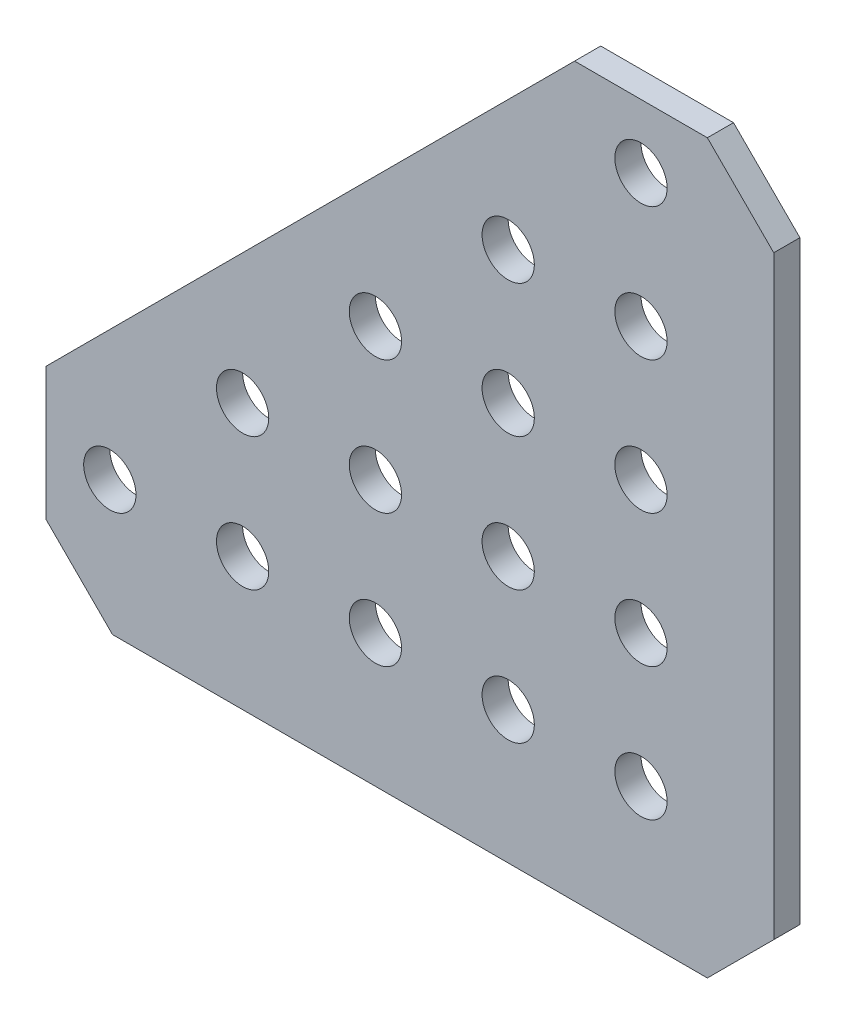
ISO-10303-21;
HEADER;
FILE_DESCRIPTION(('STEP AP214'),'2;1');
FILE_NAME('part.step','',(''),(''),'','','');
FILE_SCHEMA(('AUTOMOTIVE_DESIGN { 1 0 10303 214 1 1 1 1 }'));
ENDSEC;
DATA;
#1=APPLICATION_CONTEXT('core data for automotive mechanical design processes');
#2=APPLICATION_PROTOCOL_DEFINITION('international standard','automotive_design',2000,#1);
#3=PRODUCT_CONTEXT('',#1,'mechanical');
#4=PRODUCT('Part','Part','',(#3));
#5=PRODUCT_RELATED_PRODUCT_CATEGORY('part','',(#4));
#6=PRODUCT_DEFINITION_FORMATION('','',#4);
#7=PRODUCT_DEFINITION_CONTEXT('part definition',#1,'design');
#8=PRODUCT_DEFINITION('design','',#6,#7);
#9=PRODUCT_DEFINITION_SHAPE('','',#8);
#10=(LENGTH_UNIT() NAMED_UNIT(*) SI_UNIT(.MILLI.,.METRE.));
#11=(NAMED_UNIT(*) PLANE_ANGLE_UNIT() SI_UNIT($,.RADIAN.));
#12=(NAMED_UNIT(*) SI_UNIT($,.STERADIAN.) SOLID_ANGLE_UNIT());
#13=UNCERTAINTY_MEASURE_WITH_UNIT(LENGTH_MEASURE(1.E-05),#10,'distance_accuracy_value','');
#14=(GEOMETRIC_REPRESENTATION_CONTEXT(3) GLOBAL_UNCERTAINTY_ASSIGNED_CONTEXT((#13)) GLOBAL_UNIT_ASSIGNED_CONTEXT((#10,
#11,#12)) REPRESENTATION_CONTEXT('',''));
#15=CARTESIAN_POINT('',(0.,0.,0.));
#16=DIRECTION('',(0.,0.,1.));
#17=DIRECTION('',(1.,0.,0.));
#18=AXIS2_PLACEMENT_3D('',#15,#16,#17);
#19=CARTESIAN_POINT('',(12.7,-6.35,1.25));
#20=DIRECTION('',(0.707106781186548,-0.707106781186548,0.));
#21=DIRECTION('',(0.707106781186548,0.707106781186548,0.));
#22=AXIS2_PLACEMENT_3D('',#19,#20,#21);
#23=PLANE('',#22);
#24=DIRECTION('',(-0.707106781186547,-0.707106781186547,0.));
#25=VECTOR('',#24,1.);
#26=CARTESIAN_POINT('',(12.7,-6.35,-1.25));
#27=LINE('',#26,#25);
#28=CARTESIAN_POINT('',(12.7,-6.35,-1.25));
#29=VERTEX_POINT('',#28);
#30=CARTESIAN_POINT('',(6.35,-12.7,-1.25));
#31=VERTEX_POINT('',#30);
#32=EDGE_CURVE('E148',#29,#31,#27,.T.);
#33=ORIENTED_EDGE('',*,*,#32,.F.);
#34=DIRECTION('',(0.,0.,-1.));
#35=VECTOR('',#34,1.);
#36=CARTESIAN_POINT('',(12.7,-6.35,1.25));
#37=LINE('',#36,#35);
#38=CARTESIAN_POINT('',(12.7,-6.35,1.25));
#39=VERTEX_POINT('',#38);
#40=EDGE_CURVE('E11',#39,#29,#37,.T.);
#41=ORIENTED_EDGE('',*,*,#40,.F.);
#42=DIRECTION('',(-0.707106781186547,-0.707106781186547,0.));
#43=VECTOR('',#42,1.);
#44=CARTESIAN_POINT('',(12.7,-6.35,1.25));
#45=LINE('',#44,#43);
#46=CARTESIAN_POINT('',(6.35,-12.7,1.25));
#47=VERTEX_POINT('',#46);
#48=EDGE_CURVE('E177',#39,#47,#45,.T.);
#49=ORIENTED_EDGE('',*,*,#48,.T.);
#50=DIRECTION('',(0.,0.,-1.));
#51=VECTOR('',#50,1.);
#52=CARTESIAN_POINT('',(6.35,-12.7,1.25));
#53=LINE('',#52,#51);
#54=EDGE_CURVE('E48',#47,#31,#53,.T.);
#55=ORIENTED_EDGE('',*,*,#54,.T.);
#56=EDGE_LOOP('',(#33,#41,#49,#55));
#57=FACE_BOUND('',#56,.T.);
#58=ADVANCED_FACE('F45',(#57),#23,.T.);
#59=CARTESIAN_POINT('',(12.6999999999998,50.546,1.25));
#60=DIRECTION('',(1.,0.,0.));
#61=DIRECTION('',(0.,1.,0.));
#62=AXIS2_PLACEMENT_3D('',#59,#60,#61);
#63=PLANE('',#62);
#64=DIRECTION('',(0.,-1.,0.));
#65=VECTOR('',#64,1.);
#66=CARTESIAN_POINT('',(12.6999999999998,50.546,-1.25));
#67=LINE('',#66,#65);
#68=CARTESIAN_POINT('',(12.6999999999998,50.546,-1.25));
#69=VERTEX_POINT('',#68);
#70=EDGE_CURVE('E174',#69,#29,#67,.T.);
#71=ORIENTED_EDGE('',*,*,#70,.F.);
#72=DIRECTION('',(0.,0.,-1.));
#73=VECTOR('',#72,1.);
#74=CARTESIAN_POINT('',(12.6999999999998,50.546,1.25));
#75=LINE('',#74,#73);
#76=CARTESIAN_POINT('',(12.6999999999998,50.546,1.25));
#77=VERTEX_POINT('',#76);
#78=EDGE_CURVE('E55',#77,#69,#75,.T.);
#79=ORIENTED_EDGE('',*,*,#78,.F.);
#80=DIRECTION('',(0.,-1.,0.));
#81=VECTOR('',#80,1.);
#82=CARTESIAN_POINT('',(12.6999999999998,50.546,1.25));
#83=LINE('',#82,#81);
#84=EDGE_CURVE('E134',#77,#39,#83,.T.);
#85=ORIENTED_EDGE('',*,*,#84,.T.);
#86=ORIENTED_EDGE('',*,*,#40,.T.);
#87=EDGE_LOOP('',(#71,#79,#85,#86));
#88=FACE_BOUND('',#87,.T.);
#89=ADVANCED_FACE('F195',(#88),#63,.T.);
#90=CARTESIAN_POINT('',(6.34999999999981,56.896,1.25));
#91=DIRECTION('',(0.707106781186546,0.707106781186549,0.));
#92=DIRECTION('',(-0.707106781186549,0.707106781186546,0.));
#93=AXIS2_PLACEMENT_3D('',#90,#91,#92);
#94=PLANE('',#93);
#95=DIRECTION('',(0.707106781186549,-0.707106781186546,0.));
#96=VECTOR('',#95,1.);
#97=CARTESIAN_POINT('',(6.34999999999981,56.896,-1.25));
#98=LINE('',#97,#96);
#99=CARTESIAN_POINT('',(6.34999999999981,56.896,-1.25));
#100=VERTEX_POINT('',#99);
#101=EDGE_CURVE('E120',#100,#69,#98,.T.);
#102=ORIENTED_EDGE('',*,*,#101,.F.);
#103=DIRECTION('',(0.,0.,-1.));
#104=VECTOR('',#103,1.);
#105=CARTESIAN_POINT('',(6.34999999999981,56.896,1.25));
#106=LINE('',#105,#104);
#107=CARTESIAN_POINT('',(6.34999999999981,56.896,1.25));
#108=VERTEX_POINT('',#107);
#109=EDGE_CURVE('E115',#108,#100,#106,.T.);
#110=ORIENTED_EDGE('',*,*,#109,.F.);
#111=DIRECTION('',(0.707106781186549,-0.707106781186546,0.));
#112=VECTOR('',#111,1.);
#113=CARTESIAN_POINT('',(6.34999999999981,56.896,1.25));
#114=LINE('',#113,#112);
#115=EDGE_CURVE('E118',#108,#77,#114,.T.);
#116=ORIENTED_EDGE('',*,*,#115,.T.);
#117=ORIENTED_EDGE('',*,*,#78,.T.);
#118=EDGE_LOOP('',(#102,#110,#116,#117));
#119=FACE_BOUND('',#118,.T.);
#120=ADVANCED_FACE('F117',(#119),#94,.T.);
#121=CARTESIAN_POINT('',(-6.35000000000021,56.896,1.25));
#122=DIRECTION('',(0.,1.,0.));
#123=DIRECTION('',(0.,0.,1.));
#124=AXIS2_PLACEMENT_3D('',#121,#122,#123);
#125=PLANE('',#124);
#126=DIRECTION('',(1.,0.,0.));
#127=VECTOR('',#126,1.);
#128=CARTESIAN_POINT('',(-6.35000000000021,56.896,-1.25));
#129=LINE('',#128,#127);
#130=CARTESIAN_POINT('',(-6.35000000000021,56.896,-1.25));
#131=VERTEX_POINT('',#130);
#132=EDGE_CURVE('E169',#131,#100,#129,.T.);
#133=ORIENTED_EDGE('',*,*,#132,.F.);
#134=DIRECTION('',(0.,0.,-1.));
#135=VECTOR('',#134,1.);
#136=CARTESIAN_POINT('',(-6.35000000000021,56.896,1.25));
#137=LINE('',#136,#135);
#138=CARTESIAN_POINT('',(-6.35000000000021,56.896,1.25));
#139=VERTEX_POINT('',#138);
#140=EDGE_CURVE('E126',#139,#131,#137,.T.);
#141=ORIENTED_EDGE('',*,*,#140,.F.);
#142=DIRECTION('',(1.,0.,0.));
#143=VECTOR('',#142,1.);
#144=CARTESIAN_POINT('',(-6.35000000000021,56.896,1.25));
#145=LINE('',#144,#143);
#146=EDGE_CURVE('E132',#139,#108,#145,.T.);
#147=ORIENTED_EDGE('',*,*,#146,.T.);
#148=ORIENTED_EDGE('',*,*,#109,.T.);
#149=EDGE_LOOP('',(#133,#141,#147,#148));
#150=FACE_BOUND('',#149,.T.);
#151=ADVANCED_FACE('F137',(#150),#125,.T.);
#152=CARTESIAN_POINT('',(-56.896,6.35,1.25));
#153=DIRECTION('',(-0.707106781186549,0.707106781186546,0.));
#154=DIRECTION('',(-0.707106781186546,-0.707106781186549,0.));
#155=AXIS2_PLACEMENT_3D('',#152,#153,#154);
#156=PLANE('',#155);
#157=DIRECTION('',(0.707106781186546,0.707106781186549,0.));
#158=VECTOR('',#157,1.);
#159=CARTESIAN_POINT('',(-56.896,6.35,-1.25));
#160=LINE('',#159,#158);
#161=CARTESIAN_POINT('',(-56.896,6.35,-1.25));
#162=VERTEX_POINT('',#161);
#163=EDGE_CURVE('E165',#162,#131,#160,.T.);
#164=ORIENTED_EDGE('',*,*,#163,.F.);
#165=DIRECTION('',(0.,0.,-1.));
#166=VECTOR('',#165,1.);
#167=CARTESIAN_POINT('',(-56.896,6.35,1.25));
#168=LINE('',#167,#166);
#169=CARTESIAN_POINT('',(-56.896,6.35,1.25));
#170=VERTEX_POINT('',#169);
#171=EDGE_CURVE('E183',#170,#162,#168,.T.);
#172=ORIENTED_EDGE('',*,*,#171,.F.);
#173=DIRECTION('',(0.707106781186546,0.707106781186549,0.));
#174=VECTOR('',#173,1.);
#175=CARTESIAN_POINT('',(-56.896,6.35,1.25));
#176=LINE('',#175,#174);
#177=EDGE_CURVE('E139',#170,#139,#176,.T.);
#178=ORIENTED_EDGE('',*,*,#177,.T.);
#179=ORIENTED_EDGE('',*,*,#140,.T.);
#180=EDGE_LOOP('',(#164,#172,#178,#179));
#181=FACE_BOUND('',#180,.T.);
#182=ADVANCED_FACE('F208',(#181),#156,.T.);
#183=CARTESIAN_POINT('',(-56.896,-6.35,1.25));
#184=DIRECTION('',(-1.,0.,0.));
#185=DIRECTION('',(0.,0.,1.));
#186=AXIS2_PLACEMENT_3D('',#183,#184,#185);
#187=PLANE('',#186);
#188=DIRECTION('',(0.,1.,0.));
#189=VECTOR('',#188,1.);
#190=CARTESIAN_POINT('',(-56.896,-6.35,-1.25));
#191=LINE('',#190,#189);
#192=CARTESIAN_POINT('',(-56.896,-6.35,-1.25));
#193=VERTEX_POINT('',#192);
#194=EDGE_CURVE('E161',#193,#162,#191,.T.);
#195=ORIENTED_EDGE('',*,*,#194,.F.);
#196=DIRECTION('',(0.,0.,-1.));
#197=VECTOR('',#196,1.);
#198=CARTESIAN_POINT('',(-56.896,-6.35,1.25));
#199=LINE('',#198,#197);
#200=CARTESIAN_POINT('',(-56.896,-6.35,1.25));
#201=VERTEX_POINT('',#200);
#202=EDGE_CURVE('E186',#201,#193,#199,.T.);
#203=ORIENTED_EDGE('',*,*,#202,.F.);
#204=DIRECTION('',(0.,1.,0.));
#205=VECTOR('',#204,1.);
#206=CARTESIAN_POINT('',(-56.896,-6.35,1.25));
#207=LINE('',#206,#205);
#208=EDGE_CURVE('E142',#201,#170,#207,.T.);
#209=ORIENTED_EDGE('',*,*,#208,.T.);
#210=ORIENTED_EDGE('',*,*,#171,.T.);
#211=EDGE_LOOP('',(#195,#203,#209,#210));
#212=FACE_BOUND('',#211,.T.);
#213=ADVANCED_FACE('F211',(#212),#187,.T.);
#214=CARTESIAN_POINT('',(-50.546,-12.7,1.25));
#215=DIRECTION('',(-0.707106781186547,-0.707106781186548,0.));
#216=DIRECTION('',(0.707106781186548,-0.707106781186547,0.));
#217=AXIS2_PLACEMENT_3D('',#214,#215,#216);
#218=PLANE('',#217);
#219=DIRECTION('',(-0.707106781186548,0.707106781186547,0.));
#220=VECTOR('',#219,1.);
#221=CARTESIAN_POINT('',(-50.546,-12.7,-1.25));
#222=LINE('',#221,#220);
#223=CARTESIAN_POINT('',(-50.546,-12.7,-1.25));
#224=VERTEX_POINT('',#223);
#225=EDGE_CURVE('E157',#224,#193,#222,.T.);
#226=ORIENTED_EDGE('',*,*,#225,.F.);
#227=DIRECTION('',(0.,0.,-1.));
#228=VECTOR('',#227,1.);
#229=CARTESIAN_POINT('',(-50.546,-12.7,1.25));
#230=LINE('',#229,#228);
#231=CARTESIAN_POINT('',(-50.546,-12.7,1.25));
#232=VERTEX_POINT('',#231);
#233=EDGE_CURVE('E188',#232,#224,#230,.T.);
#234=ORIENTED_EDGE('',*,*,#233,.F.);
#235=DIRECTION('',(-0.707106781186548,0.707106781186547,0.));
#236=VECTOR('',#235,1.);
#237=CARTESIAN_POINT('',(-50.546,-12.7,1.25));
#238=LINE('',#237,#236);
#239=EDGE_CURVE('E419',#232,#201,#238,.T.);
#240=ORIENTED_EDGE('',*,*,#239,.T.);
#241=ORIENTED_EDGE('',*,*,#202,.T.);
#242=EDGE_LOOP('',(#226,#234,#240,#241));
#243=FACE_BOUND('',#242,.T.);
#244=ADVANCED_FACE('F215',(#243),#218,.T.);
#245=CARTESIAN_POINT('',(6.35,-12.7,1.25));
#246=DIRECTION('',(0.,-1.,0.));
#247=DIRECTION('',(0.,0.,-1.));
#248=AXIS2_PLACEMENT_3D('',#245,#246,#247);
#249=PLANE('',#248);
#250=DIRECTION('',(-1.,0.,0.));
#251=VECTOR('',#250,1.);
#252=CARTESIAN_POINT('',(6.35,-12.7,-1.25));
#253=LINE('',#252,#251);
#254=EDGE_CURVE('E152',#31,#224,#253,.T.);
#255=ORIENTED_EDGE('',*,*,#254,.F.);
#256=ORIENTED_EDGE('',*,*,#54,.F.);
#257=DIRECTION('',(-1.,0.,0.));
#258=VECTOR('',#257,1.);
#259=CARTESIAN_POINT('',(6.35,-12.7,1.25));
#260=LINE('',#259,#258);
#261=EDGE_CURVE('E416',#47,#232,#260,.T.);
#262=ORIENTED_EDGE('',*,*,#261,.T.);
#263=ORIENTED_EDGE('',*,*,#233,.T.);
#264=EDGE_LOOP('',(#255,#256,#262,#263));
#265=FACE_BOUND('',#264,.T.);
#266=ADVANCED_FACE('F192',(#265),#249,.T.);
#267=CARTESIAN_POINT('',(0.,0.,1.25));
#268=DIRECTION('',(0.,0.,-1.));
#269=DIRECTION('',(-1.,0.,0.));
#270=AXIS2_PLACEMENT_3D('',#267,#268,#269);
#271=PLANE('',#270);
#272=CARTESIAN_POINT('',(-38.1,12.7,1.25));
#273=DIRECTION('',(0.,0.,-1.));
#274=DIRECTION('',(1.,0.,0.));
#275=AXIS2_PLACEMENT_3D('',#272,#273,#274);
#276=CIRCLE('',#275,2.5);
#277=CARTESIAN_POINT('',(-35.6,12.7,1.25));
#278=VERTEX_POINT('',#277);
#279=EDGE_CURVE('E294',#278,#278,#276,.T.);
#280=ORIENTED_EDGE('',*,*,#279,.T.);
#281=EDGE_LOOP('',(#280));
#282=FACE_BOUND('',#281,.T.);
#283=CARTESIAN_POINT('',(-25.4,25.4,1.25));
#284=DIRECTION('',(0.,0.,-1.));
#285=DIRECTION('',(1.,0.,0.));
#286=AXIS2_PLACEMENT_3D('',#283,#284,#285);
#287=CIRCLE('',#286,2.5);
#288=CARTESIAN_POINT('',(-22.9,25.4,1.25));
#289=VERTEX_POINT('',#288);
#290=EDGE_CURVE('E304',#289,#289,#287,.T.);
#291=ORIENTED_EDGE('',*,*,#290,.T.);
#292=EDGE_LOOP('',(#291));
#293=FACE_BOUND('',#292,.T.);
#294=CARTESIAN_POINT('',(-25.4,12.7,1.25));
#295=DIRECTION('',(0.,0.,-1.));
#296=DIRECTION('',(1.,0.,0.));
#297=AXIS2_PLACEMENT_3D('',#294,#295,#296);
#298=CIRCLE('',#297,2.5);
#299=CARTESIAN_POINT('',(-22.9,12.7,1.25));
#300=VERTEX_POINT('',#299);
#301=EDGE_CURVE('E312',#300,#300,#298,.T.);
#302=ORIENTED_EDGE('',*,*,#301,.T.);
#303=EDGE_LOOP('',(#302));
#304=FACE_BOUND('',#303,.T.);
#305=CARTESIAN_POINT('',(-12.7,38.1,1.25));
#306=DIRECTION('',(0.,0.,-1.));
#307=DIRECTION('',(1.,0.,0.));
#308=AXIS2_PLACEMENT_3D('',#305,#306,#307);
#309=CIRCLE('',#308,2.5);
#310=CARTESIAN_POINT('',(-10.2,38.1,1.25));
#311=VERTEX_POINT('',#310);
#312=EDGE_CURVE('E320',#311,#311,#309,.T.);
#313=ORIENTED_EDGE('',*,*,#312,.T.);
#314=EDGE_LOOP('',(#313));
#315=FACE_BOUND('',#314,.T.);
#316=CARTESIAN_POINT('',(-12.7,25.4,1.25));
#317=DIRECTION('',(0.,0.,-1.));
#318=DIRECTION('',(1.,0.,0.));
#319=AXIS2_PLACEMENT_3D('',#316,#317,#318);
#320=CIRCLE('',#319,2.5);
#321=CARTESIAN_POINT('',(-10.2,25.4,1.25));
#322=VERTEX_POINT('',#321);
#323=EDGE_CURVE('E328',#322,#322,#320,.T.);
#324=ORIENTED_EDGE('',*,*,#323,.T.);
#325=EDGE_LOOP('',(#324));
#326=FACE_BOUND('',#325,.T.);
#327=CARTESIAN_POINT('',(-12.7,12.7,1.25));
#328=DIRECTION('',(0.,0.,-1.));
#329=DIRECTION('',(1.,0.,0.));
#330=AXIS2_PLACEMENT_3D('',#327,#328,#329);
#331=CIRCLE('',#330,2.5);
#332=CARTESIAN_POINT('',(-10.2,12.7,1.25));
#333=VERTEX_POINT('',#332);
#334=EDGE_CURVE('E336',#333,#333,#331,.T.);
#335=ORIENTED_EDGE('',*,*,#334,.T.);
#336=EDGE_LOOP('',(#335));
#337=FACE_BOUND('',#336,.T.);
#338=CARTESIAN_POINT('',(0.,38.1,1.25));
#339=DIRECTION('',(0.,0.,-1.));
#340=DIRECTION('',(1.,0.,0.));
#341=AXIS2_PLACEMENT_3D('',#338,#339,#340);
#342=CIRCLE('',#341,2.5);
#343=CARTESIAN_POINT('',(2.50000000000004,38.1,1.25));
#344=VERTEX_POINT('',#343);
#345=EDGE_CURVE('E344',#344,#344,#342,.T.);
#346=ORIENTED_EDGE('',*,*,#345,.T.);
#347=EDGE_LOOP('',(#346));
#348=FACE_BOUND('',#347,.T.);
#349=CARTESIAN_POINT('',(0.,50.8,1.25));
#350=DIRECTION('',(0.,0.,-1.));
#351=DIRECTION('',(1.,0.,0.));
#352=AXIS2_PLACEMENT_3D('',#349,#350,#351);
#353=CIRCLE('',#352,2.5);
#354=CARTESIAN_POINT('',(2.5,50.8,1.25));
#355=VERTEX_POINT('',#354);
#356=EDGE_CURVE('E352',#355,#355,#353,.T.);
#357=ORIENTED_EDGE('',*,*,#356,.T.);
#358=EDGE_LOOP('',(#357));
#359=FACE_BOUND('',#358,.T.);
#360=CARTESIAN_POINT('',(-38.1,0.,1.25));
#361=DIRECTION('',(0.,0.,-1.));
#362=DIRECTION('',(1.,0.,0.));
#363=AXIS2_PLACEMENT_3D('',#360,#361,#362);
#364=CIRCLE('',#363,2.5);
#365=CARTESIAN_POINT('',(-35.6,0.,1.25));
#366=VERTEX_POINT('',#365);
#367=EDGE_CURVE('E360',#366,#366,#364,.T.);
#368=ORIENTED_EDGE('',*,*,#367,.T.);
#369=EDGE_LOOP('',(#368));
#370=FACE_BOUND('',#369,.T.);
#371=CARTESIAN_POINT('',(-50.8,0.,1.25));
#372=DIRECTION('',(0.,0.,-1.));
#373=DIRECTION('',(1.,0.,0.));
#374=AXIS2_PLACEMENT_3D('',#371,#372,#373);
#375=CIRCLE('',#374,2.5);
#376=CARTESIAN_POINT('',(-48.3,0.,1.25));
#377=VERTEX_POINT('',#376);
#378=EDGE_CURVE('E368',#377,#377,#375,.T.);
#379=ORIENTED_EDGE('',*,*,#378,.T.);
#380=EDGE_LOOP('',(#379));
#381=FACE_BOUND('',#380,.T.);
#382=CARTESIAN_POINT('',(0.,0.,1.25));
#383=DIRECTION('',(0.,0.,-1.));
#384=DIRECTION('',(1.,0.,0.));
#385=AXIS2_PLACEMENT_3D('',#382,#383,#384);
#386=CIRCLE('',#385,2.5);
#387=CARTESIAN_POINT('',(2.5,0.,1.25));
#388=VERTEX_POINT('',#387);
#389=EDGE_CURVE('E376',#388,#388,#386,.T.);
#390=ORIENTED_EDGE('',*,*,#389,.T.);
#391=EDGE_LOOP('',(#390));
#392=FACE_BOUND('',#391,.T.);
#393=CARTESIAN_POINT('',(-25.4,0.,1.25));
#394=DIRECTION('',(0.,0.,-1.));
#395=DIRECTION('',(1.,0.,0.));
#396=AXIS2_PLACEMENT_3D('',#393,#394,#395);
#397=CIRCLE('',#396,2.5);
#398=CARTESIAN_POINT('',(-22.9,0.,1.25));
#399=VERTEX_POINT('',#398);
#400=EDGE_CURVE('E384',#399,#399,#397,.T.);
#401=ORIENTED_EDGE('',*,*,#400,.T.);
#402=EDGE_LOOP('',(#401));
#403=FACE_BOUND('',#402,.T.);
#404=CARTESIAN_POINT('',(-12.7,0.,1.25));
#405=DIRECTION('',(0.,0.,-1.));
#406=DIRECTION('',(1.,0.,0.));
#407=AXIS2_PLACEMENT_3D('',#404,#405,#406);
#408=CIRCLE('',#407,2.5);
#409=CARTESIAN_POINT('',(-10.2,0.,1.25));
#410=VERTEX_POINT('',#409);
#411=EDGE_CURVE('E392',#410,#410,#408,.T.);
#412=ORIENTED_EDGE('',*,*,#411,.T.);
#413=EDGE_LOOP('',(#412));
#414=FACE_BOUND('',#413,.T.);
#415=CARTESIAN_POINT('',(0.,25.4,1.25));
#416=DIRECTION('',(0.,0.,-1.));
#417=DIRECTION('',(1.,0.,0.));
#418=AXIS2_PLACEMENT_3D('',#415,#416,#417);
#419=CIRCLE('',#418,2.5);
#420=CARTESIAN_POINT('',(2.50000000000008,25.4,1.25));
#421=VERTEX_POINT('',#420);
#422=EDGE_CURVE('E400',#421,#421,#419,.T.);
#423=ORIENTED_EDGE('',*,*,#422,.T.);
#424=EDGE_LOOP('',(#423));
#425=FACE_BOUND('',#424,.T.);
#426=CARTESIAN_POINT('',(1.19131612205636E-13,12.7,1.25));
#427=DIRECTION('',(0.,0.,-1.));
#428=DIRECTION('',(1.,0.,0.));
#429=AXIS2_PLACEMENT_3D('',#426,#427,#428);
#430=CIRCLE('',#429,2.5);
#431=CARTESIAN_POINT('',(2.50000000000012,12.7,1.25));
#432=VERTEX_POINT('',#431);
#433=EDGE_CURVE('E153',#432,#432,#430,.T.);
#434=ORIENTED_EDGE('',*,*,#433,.T.);
#435=EDGE_LOOP('',(#434));
#436=FACE_BOUND('',#435,.T.);
#437=ORIENTED_EDGE('',*,*,#48,.F.);
#438=ORIENTED_EDGE('',*,*,#84,.F.);
#439=ORIENTED_EDGE('',*,*,#115,.F.);
#440=ORIENTED_EDGE('',*,*,#146,.F.);
#441=ORIENTED_EDGE('',*,*,#177,.F.);
#442=ORIENTED_EDGE('',*,*,#208,.F.);
#443=ORIENTED_EDGE('',*,*,#239,.F.);
#444=ORIENTED_EDGE('',*,*,#261,.F.);
#445=EDGE_LOOP('',(#437,#438,#439,#440,#441,#442,#443,#444));
#446=FACE_BOUND('',#445,.T.);
#447=ADVANCED_FACE('F130',(#282,#293,#304,#315,#326,#337,#348,#359,#370,#381,#392,#403,#414,
#425,#436,#446),#271,.F.);
#448=CARTESIAN_POINT('',(0.,0.,-1.25));
#449=DIRECTION('',(0.,0.,-1.));
#450=DIRECTION('',(-1.,0.,0.));
#451=AXIS2_PLACEMENT_3D('',#448,#449,#450);
#452=PLANE('',#451);
#453=CARTESIAN_POINT('',(-38.1,12.7,-1.25));
#454=DIRECTION('',(0.,0.,-1.));
#455=DIRECTION('',(1.,0.,0.));
#456=AXIS2_PLACEMENT_3D('',#453,#454,#455);
#457=CIRCLE('',#456,2.5);
#458=CARTESIAN_POINT('',(-35.6,12.7,-1.25));
#459=VERTEX_POINT('',#458);
#460=EDGE_CURVE('E297',#459,#459,#457,.T.);
#461=ORIENTED_EDGE('',*,*,#460,.F.);
#462=EDGE_LOOP('',(#461));
#463=FACE_BOUND('',#462,.T.);
#464=CARTESIAN_POINT('',(-25.4,25.4,-1.25));
#465=DIRECTION('',(0.,0.,-1.));
#466=DIRECTION('',(1.,0.,0.));
#467=AXIS2_PLACEMENT_3D('',#464,#465,#466);
#468=CIRCLE('',#467,2.5);
#469=CARTESIAN_POINT('',(-22.9,25.4,-1.25));
#470=VERTEX_POINT('',#469);
#471=EDGE_CURVE('E301',#470,#470,#468,.T.);
#472=ORIENTED_EDGE('',*,*,#471,.F.);
#473=EDGE_LOOP('',(#472));
#474=FACE_BOUND('',#473,.T.);
#475=CARTESIAN_POINT('',(-25.4,12.7,-1.25));
#476=DIRECTION('',(0.,0.,-1.));
#477=DIRECTION('',(1.,0.,0.));
#478=AXIS2_PLACEMENT_3D('',#475,#476,#477);
#479=CIRCLE('',#478,2.5);
#480=CARTESIAN_POINT('',(-22.9,12.7,-1.25));
#481=VERTEX_POINT('',#480);
#482=EDGE_CURVE('E308',#481,#481,#479,.T.);
#483=ORIENTED_EDGE('',*,*,#482,.F.);
#484=EDGE_LOOP('',(#483));
#485=FACE_BOUND('',#484,.T.);
#486=CARTESIAN_POINT('',(-12.7,38.1,-1.25));
#487=DIRECTION('',(0.,0.,-1.));
#488=DIRECTION('',(1.,0.,0.));
#489=AXIS2_PLACEMENT_3D('',#486,#487,#488);
#490=CIRCLE('',#489,2.5);
#491=CARTESIAN_POINT('',(-10.2,38.1,-1.25));
#492=VERTEX_POINT('',#491);
#493=EDGE_CURVE('E316',#492,#492,#490,.T.);
#494=ORIENTED_EDGE('',*,*,#493,.F.);
#495=EDGE_LOOP('',(#494));
#496=FACE_BOUND('',#495,.T.);
#497=CARTESIAN_POINT('',(-12.7,25.4,-1.25));
#498=DIRECTION('',(0.,0.,-1.));
#499=DIRECTION('',(1.,0.,0.));
#500=AXIS2_PLACEMENT_3D('',#497,#498,#499);
#501=CIRCLE('',#500,2.5);
#502=CARTESIAN_POINT('',(-10.2,25.4,-1.25));
#503=VERTEX_POINT('',#502);
#504=EDGE_CURVE('E324',#503,#503,#501,.T.);
#505=ORIENTED_EDGE('',*,*,#504,.F.);
#506=EDGE_LOOP('',(#505));
#507=FACE_BOUND('',#506,.T.);
#508=CARTESIAN_POINT('',(-12.7,12.7,-1.25));
#509=DIRECTION('',(0.,0.,-1.));
#510=DIRECTION('',(1.,0.,0.));
#511=AXIS2_PLACEMENT_3D('',#508,#509,#510);
#512=CIRCLE('',#511,2.5);
#513=CARTESIAN_POINT('',(-10.2,12.7,-1.25));
#514=VERTEX_POINT('',#513);
#515=EDGE_CURVE('E332',#514,#514,#512,.T.);
#516=ORIENTED_EDGE('',*,*,#515,.F.);
#517=EDGE_LOOP('',(#516));
#518=FACE_BOUND('',#517,.T.);
#519=CARTESIAN_POINT('',(0.,38.1,-1.25));
#520=DIRECTION('',(0.,0.,-1.));
#521=DIRECTION('',(1.,0.,0.));
#522=AXIS2_PLACEMENT_3D('',#519,#520,#521);
#523=CIRCLE('',#522,2.5);
#524=CARTESIAN_POINT('',(2.50000000000004,38.1,-1.25));
#525=VERTEX_POINT('',#524);
#526=EDGE_CURVE('E340',#525,#525,#523,.T.);
#527=ORIENTED_EDGE('',*,*,#526,.F.);
#528=EDGE_LOOP('',(#527));
#529=FACE_BOUND('',#528,.T.);
#530=CARTESIAN_POINT('',(0.,50.8,-1.25));
#531=DIRECTION('',(0.,0.,-1.));
#532=DIRECTION('',(1.,0.,0.));
#533=AXIS2_PLACEMENT_3D('',#530,#531,#532);
#534=CIRCLE('',#533,2.5);
#535=CARTESIAN_POINT('',(2.5,50.8,-1.25));
#536=VERTEX_POINT('',#535);
#537=EDGE_CURVE('E348',#536,#536,#534,.T.);
#538=ORIENTED_EDGE('',*,*,#537,.F.);
#539=EDGE_LOOP('',(#538));
#540=FACE_BOUND('',#539,.T.);
#541=CARTESIAN_POINT('',(-38.1,0.,-1.25));
#542=DIRECTION('',(0.,0.,-1.));
#543=DIRECTION('',(1.,0.,0.));
#544=AXIS2_PLACEMENT_3D('',#541,#542,#543);
#545=CIRCLE('',#544,2.5);
#546=CARTESIAN_POINT('',(-35.6,0.,-1.25));
#547=VERTEX_POINT('',#546);
#548=EDGE_CURVE('E356',#547,#547,#545,.T.);
#549=ORIENTED_EDGE('',*,*,#548,.F.);
#550=EDGE_LOOP('',(#549));
#551=FACE_BOUND('',#550,.T.);
#552=CARTESIAN_POINT('',(-50.8,0.,-1.25));
#553=DIRECTION('',(0.,0.,-1.));
#554=DIRECTION('',(1.,0.,0.));
#555=AXIS2_PLACEMENT_3D('',#552,#553,#554);
#556=CIRCLE('',#555,2.5);
#557=CARTESIAN_POINT('',(-48.3,0.,-1.25));
#558=VERTEX_POINT('',#557);
#559=EDGE_CURVE('E364',#558,#558,#556,.T.);
#560=ORIENTED_EDGE('',*,*,#559,.F.);
#561=EDGE_LOOP('',(#560));
#562=FACE_BOUND('',#561,.T.);
#563=CARTESIAN_POINT('',(0.,0.,-1.25));
#564=DIRECTION('',(0.,0.,-1.));
#565=DIRECTION('',(1.,0.,0.));
#566=AXIS2_PLACEMENT_3D('',#563,#564,#565);
#567=CIRCLE('',#566,2.5);
#568=CARTESIAN_POINT('',(2.5,0.,-1.25));
#569=VERTEX_POINT('',#568);
#570=EDGE_CURVE('E372',#569,#569,#567,.T.);
#571=ORIENTED_EDGE('',*,*,#570,.F.);
#572=EDGE_LOOP('',(#571));
#573=FACE_BOUND('',#572,.T.);
#574=CARTESIAN_POINT('',(-25.4,0.,-1.25));
#575=DIRECTION('',(0.,0.,-1.));
#576=DIRECTION('',(1.,0.,0.));
#577=AXIS2_PLACEMENT_3D('',#574,#575,#576);
#578=CIRCLE('',#577,2.5);
#579=CARTESIAN_POINT('',(-22.9,0.,-1.25));
#580=VERTEX_POINT('',#579);
#581=EDGE_CURVE('E380',#580,#580,#578,.T.);
#582=ORIENTED_EDGE('',*,*,#581,.F.);
#583=EDGE_LOOP('',(#582));
#584=FACE_BOUND('',#583,.T.);
#585=CARTESIAN_POINT('',(-12.7,0.,-1.25));
#586=DIRECTION('',(0.,0.,-1.));
#587=DIRECTION('',(1.,0.,0.));
#588=AXIS2_PLACEMENT_3D('',#585,#586,#587);
#589=CIRCLE('',#588,2.5);
#590=CARTESIAN_POINT('',(-10.2,0.,-1.25));
#591=VERTEX_POINT('',#590);
#592=EDGE_CURVE('E388',#591,#591,#589,.T.);
#593=ORIENTED_EDGE('',*,*,#592,.F.);
#594=EDGE_LOOP('',(#593));
#595=FACE_BOUND('',#594,.T.);
#596=CARTESIAN_POINT('',(0.,25.4,-1.25));
#597=DIRECTION('',(0.,0.,-1.));
#598=DIRECTION('',(1.,0.,0.));
#599=AXIS2_PLACEMENT_3D('',#596,#597,#598);
#600=CIRCLE('',#599,2.5);
#601=CARTESIAN_POINT('',(2.50000000000008,25.4,-1.25));
#602=VERTEX_POINT('',#601);
#603=EDGE_CURVE('E396',#602,#602,#600,.T.);
#604=ORIENTED_EDGE('',*,*,#603,.F.);
#605=EDGE_LOOP('',(#604));
#606=FACE_BOUND('',#605,.T.);
#607=CARTESIAN_POINT('',(1.19131612205636E-13,12.7,-1.25));
#608=DIRECTION('',(0.,0.,-1.));
#609=DIRECTION('',(1.,0.,0.));
#610=AXIS2_PLACEMENT_3D('',#607,#608,#609);
#611=CIRCLE('',#610,2.5);
#612=CARTESIAN_POINT('',(2.50000000000012,12.7,-1.25));
#613=VERTEX_POINT('',#612);
#614=EDGE_CURVE('E404',#613,#613,#611,.T.);
#615=ORIENTED_EDGE('',*,*,#614,.F.);
#616=EDGE_LOOP('',(#615));
#617=FACE_BOUND('',#616,.T.);
#618=ORIENTED_EDGE('',*,*,#32,.T.);
#619=ORIENTED_EDGE('',*,*,#254,.T.);
#620=ORIENTED_EDGE('',*,*,#225,.T.);
#621=ORIENTED_EDGE('',*,*,#194,.T.);
#622=ORIENTED_EDGE('',*,*,#163,.T.);
#623=ORIENTED_EDGE('',*,*,#132,.T.);
#624=ORIENTED_EDGE('',*,*,#101,.T.);
#625=ORIENTED_EDGE('',*,*,#70,.T.);
#626=EDGE_LOOP('',(#618,#619,#620,#621,#622,#623,#624,#625));
#627=FACE_BOUND('',#626,.T.);
#628=ADVANCED_FACE('F194',(#463,#474,#485,#496,#507,#518,#529,#540,#551,#562,#573,#584,#595,
#606,#617,#627),#452,.T.);
#629=CARTESIAN_POINT('',(1.19131612205636E-13,12.7,1.25));
#630=DIRECTION('',(0.,0.,-1.));
#631=DIRECTION('',(-1.,0.,0.));
#632=AXIS2_PLACEMENT_3D('',#629,#630,#631);
#633=CYLINDRICAL_SURFACE('',#632,2.5);
#634=ORIENTED_EDGE('',*,*,#433,.F.);
#635=EDGE_LOOP('',(#634));
#636=FACE_BOUND('',#635,.T.);
#637=ORIENTED_EDGE('',*,*,#614,.T.);
#638=EDGE_LOOP('',(#637));
#639=FACE_BOUND('',#638,.T.);
#640=ADVANCED_FACE('F227',(#636,#639),#633,.F.);
#641=CARTESIAN_POINT('',(0.,25.4,1.25));
#642=DIRECTION('',(0.,0.,-1.));
#643=DIRECTION('',(-1.,0.,0.));
#644=AXIS2_PLACEMENT_3D('',#641,#642,#643);
#645=CYLINDRICAL_SURFACE('',#644,2.5);
#646=ORIENTED_EDGE('',*,*,#422,.F.);
#647=EDGE_LOOP('',(#646));
#648=FACE_BOUND('',#647,.T.);
#649=ORIENTED_EDGE('',*,*,#603,.T.);
#650=EDGE_LOOP('',(#649));
#651=FACE_BOUND('',#650,.T.);
#652=ADVANCED_FACE('F234',(#648,#651),#645,.F.);
#653=CARTESIAN_POINT('',(-12.7,0.,1.25));
#654=DIRECTION('',(0.,0.,-1.));
#655=DIRECTION('',(-1.,0.,0.));
#656=AXIS2_PLACEMENT_3D('',#653,#654,#655);
#657=CYLINDRICAL_SURFACE('',#656,2.5);
#658=ORIENTED_EDGE('',*,*,#411,.F.);
#659=EDGE_LOOP('',(#658));
#660=FACE_BOUND('',#659,.T.);
#661=ORIENTED_EDGE('',*,*,#592,.T.);
#662=EDGE_LOOP('',(#661));
#663=FACE_BOUND('',#662,.T.);
#664=ADVANCED_FACE('F238',(#660,#663),#657,.F.);
#665=CARTESIAN_POINT('',(-25.4,0.,1.25));
#666=DIRECTION('',(0.,0.,-1.));
#667=DIRECTION('',(-1.,0.,0.));
#668=AXIS2_PLACEMENT_3D('',#665,#666,#667);
#669=CYLINDRICAL_SURFACE('',#668,2.5);
#670=ORIENTED_EDGE('',*,*,#400,.F.);
#671=EDGE_LOOP('',(#670));
#672=FACE_BOUND('',#671,.T.);
#673=ORIENTED_EDGE('',*,*,#581,.T.);
#674=EDGE_LOOP('',(#673));
#675=FACE_BOUND('',#674,.T.);
#676=ADVANCED_FACE('F242',(#672,#675),#669,.F.);
#677=CARTESIAN_POINT('',(0.,0.,1.25));
#678=DIRECTION('',(0.,0.,-1.));
#679=DIRECTION('',(-1.,0.,0.));
#680=AXIS2_PLACEMENT_3D('',#677,#678,#679);
#681=CYLINDRICAL_SURFACE('',#680,2.5);
#682=ORIENTED_EDGE('',*,*,#389,.F.);
#683=EDGE_LOOP('',(#682));
#684=FACE_BOUND('',#683,.T.);
#685=ORIENTED_EDGE('',*,*,#570,.T.);
#686=EDGE_LOOP('',(#685));
#687=FACE_BOUND('',#686,.T.);
#688=ADVANCED_FACE('F246',(#684,#687),#681,.F.);
#689=CARTESIAN_POINT('',(-50.8,0.,1.25));
#690=DIRECTION('',(0.,0.,-1.));
#691=DIRECTION('',(-1.,0.,0.));
#692=AXIS2_PLACEMENT_3D('',#689,#690,#691);
#693=CYLINDRICAL_SURFACE('',#692,2.5);
#694=ORIENTED_EDGE('',*,*,#378,.F.);
#695=EDGE_LOOP('',(#694));
#696=FACE_BOUND('',#695,.T.);
#697=ORIENTED_EDGE('',*,*,#559,.T.);
#698=EDGE_LOOP('',(#697));
#699=FACE_BOUND('',#698,.T.);
#700=ADVANCED_FACE('F250',(#696,#699),#693,.F.);
#701=CARTESIAN_POINT('',(-38.1,0.,1.25));
#702=DIRECTION('',(0.,0.,-1.));
#703=DIRECTION('',(-1.,0.,0.));
#704=AXIS2_PLACEMENT_3D('',#701,#702,#703);
#705=CYLINDRICAL_SURFACE('',#704,2.5);
#706=ORIENTED_EDGE('',*,*,#367,.F.);
#707=EDGE_LOOP('',(#706));
#708=FACE_BOUND('',#707,.T.);
#709=ORIENTED_EDGE('',*,*,#548,.T.);
#710=EDGE_LOOP('',(#709));
#711=FACE_BOUND('',#710,.T.);
#712=ADVANCED_FACE('F254',(#708,#711),#705,.F.);
#713=CARTESIAN_POINT('',(0.,50.8,1.25));
#714=DIRECTION('',(0.,0.,-1.));
#715=DIRECTION('',(-1.,0.,0.));
#716=AXIS2_PLACEMENT_3D('',#713,#714,#715);
#717=CYLINDRICAL_SURFACE('',#716,2.5);
#718=ORIENTED_EDGE('',*,*,#356,.F.);
#719=EDGE_LOOP('',(#718));
#720=FACE_BOUND('',#719,.T.);
#721=ORIENTED_EDGE('',*,*,#537,.T.);
#722=EDGE_LOOP('',(#721));
#723=FACE_BOUND('',#722,.T.);
#724=ADVANCED_FACE('F258',(#720,#723),#717,.F.);
#725=CARTESIAN_POINT('',(0.,38.1,1.25));
#726=DIRECTION('',(0.,0.,-1.));
#727=DIRECTION('',(-1.,0.,0.));
#728=AXIS2_PLACEMENT_3D('',#725,#726,#727);
#729=CYLINDRICAL_SURFACE('',#728,2.5);
#730=ORIENTED_EDGE('',*,*,#345,.F.);
#731=EDGE_LOOP('',(#730));
#732=FACE_BOUND('',#731,.T.);
#733=ORIENTED_EDGE('',*,*,#526,.T.);
#734=EDGE_LOOP('',(#733));
#735=FACE_BOUND('',#734,.T.);
#736=ADVANCED_FACE('F262',(#732,#735),#729,.F.);
#737=CARTESIAN_POINT('',(-12.7,12.7,1.25));
#738=DIRECTION('',(0.,0.,-1.));
#739=DIRECTION('',(-1.,0.,0.));
#740=AXIS2_PLACEMENT_3D('',#737,#738,#739);
#741=CYLINDRICAL_SURFACE('',#740,2.5);
#742=ORIENTED_EDGE('',*,*,#334,.F.);
#743=EDGE_LOOP('',(#742));
#744=FACE_BOUND('',#743,.T.);
#745=ORIENTED_EDGE('',*,*,#515,.T.);
#746=EDGE_LOOP('',(#745));
#747=FACE_BOUND('',#746,.T.);
#748=ADVANCED_FACE('F266',(#744,#747),#741,.F.);
#749=CARTESIAN_POINT('',(-12.7,25.4,1.25));
#750=DIRECTION('',(0.,0.,-1.));
#751=DIRECTION('',(-1.,0.,0.));
#752=AXIS2_PLACEMENT_3D('',#749,#750,#751);
#753=CYLINDRICAL_SURFACE('',#752,2.5);
#754=ORIENTED_EDGE('',*,*,#323,.F.);
#755=EDGE_LOOP('',(#754));
#756=FACE_BOUND('',#755,.T.);
#757=ORIENTED_EDGE('',*,*,#504,.T.);
#758=EDGE_LOOP('',(#757));
#759=FACE_BOUND('',#758,.T.);
#760=ADVANCED_FACE('F270',(#756,#759),#753,.F.);
#761=CARTESIAN_POINT('',(-12.7,38.1,1.25));
#762=DIRECTION('',(0.,0.,-1.));
#763=DIRECTION('',(-1.,0.,0.));
#764=AXIS2_PLACEMENT_3D('',#761,#762,#763);
#765=CYLINDRICAL_SURFACE('',#764,2.5);
#766=ORIENTED_EDGE('',*,*,#312,.F.);
#767=EDGE_LOOP('',(#766));
#768=FACE_BOUND('',#767,.T.);
#769=ORIENTED_EDGE('',*,*,#493,.T.);
#770=EDGE_LOOP('',(#769));
#771=FACE_BOUND('',#770,.T.);
#772=ADVANCED_FACE('F274',(#768,#771),#765,.F.);
#773=CARTESIAN_POINT('',(-25.4,12.7,1.25));
#774=DIRECTION('',(0.,0.,-1.));
#775=DIRECTION('',(-1.,0.,0.));
#776=AXIS2_PLACEMENT_3D('',#773,#774,#775);
#777=CYLINDRICAL_SURFACE('',#776,2.5);
#778=ORIENTED_EDGE('',*,*,#301,.F.);
#779=EDGE_LOOP('',(#778));
#780=FACE_BOUND('',#779,.T.);
#781=ORIENTED_EDGE('',*,*,#482,.T.);
#782=EDGE_LOOP('',(#781));
#783=FACE_BOUND('',#782,.T.);
#784=ADVANCED_FACE('F278',(#780,#783),#777,.F.);
#785=CARTESIAN_POINT('',(-25.4,25.4,1.25));
#786=DIRECTION('',(0.,0.,-1.));
#787=DIRECTION('',(-1.,0.,0.));
#788=AXIS2_PLACEMENT_3D('',#785,#786,#787);
#789=CYLINDRICAL_SURFACE('',#788,2.5);
#790=ORIENTED_EDGE('',*,*,#290,.F.);
#791=EDGE_LOOP('',(#790));
#792=FACE_BOUND('',#791,.T.);
#793=ORIENTED_EDGE('',*,*,#471,.T.);
#794=EDGE_LOOP('',(#793));
#795=FACE_BOUND('',#794,.T.);
#796=ADVANCED_FACE('F282',(#792,#795),#789,.F.);
#797=CARTESIAN_POINT('',(-38.1,12.7,1.25));
#798=DIRECTION('',(0.,0.,-1.));
#799=DIRECTION('',(-1.,0.,0.));
#800=AXIS2_PLACEMENT_3D('',#797,#798,#799);
#801=CYLINDRICAL_SURFACE('',#800,2.5);
#802=ORIENTED_EDGE('',*,*,#279,.F.);
#803=EDGE_LOOP('',(#802));
#804=FACE_BOUND('',#803,.T.);
#805=ORIENTED_EDGE('',*,*,#460,.T.);
#806=EDGE_LOOP('',(#805));
#807=FACE_BOUND('',#806,.T.);
#808=ADVANCED_FACE('F286',(#804,#807),#801,.F.);
#809=CLOSED_SHELL('',(#58,#89,#120,#151,#182,#213,#244,#266,#447,#628,#640,#652,#664,#676,#688,
#700,#712,#724,#736,#748,#760,#772,#784,#796,#808));
#810=MANIFOLD_SOLID_BREP('B2',#809);
#811=ADVANCED_BREP_SHAPE_REPRESENTATION('',(#18,#810),#14);
#812=SHAPE_DEFINITION_REPRESENTATION(#9,#811);
ENDSEC;
END-ISO-10303-21;
